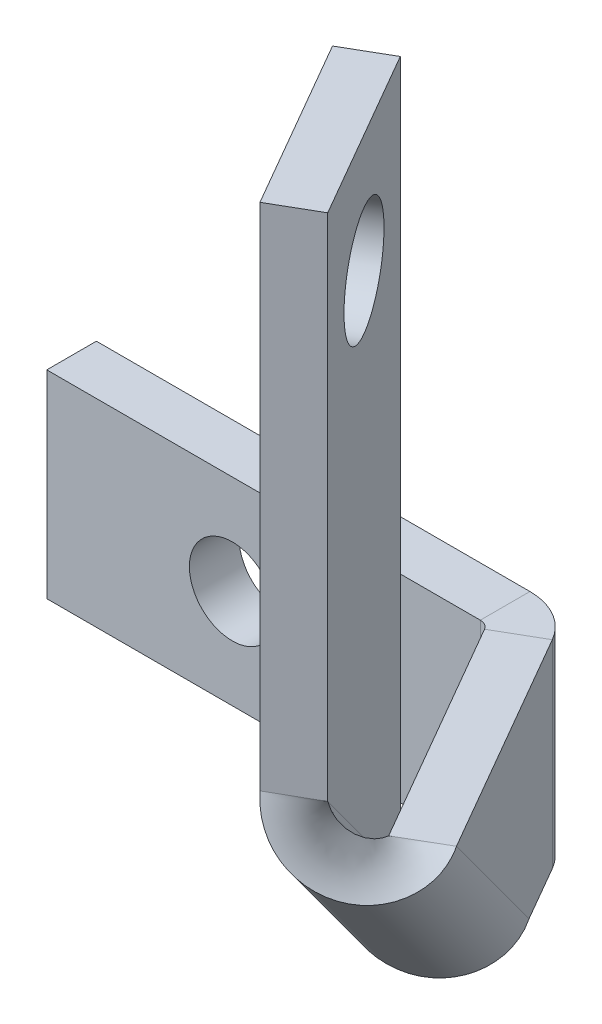
ISO-10303-21;
HEADER;
FILE_DESCRIPTION(('STEP AP214'),'2;1');
FILE_NAME('part.step','',(''),(''),'','','');
FILE_SCHEMA(('AUTOMOTIVE_DESIGN { 1 0 10303 214 1 1 1 1 }'));
ENDSEC;
DATA;
#1=APPLICATION_CONTEXT('core data for automotive mechanical design processes');
#2=APPLICATION_PROTOCOL_DEFINITION('international standard','automotive_design',2000,#1);
#3=PRODUCT_CONTEXT('',#1,'mechanical');
#4=PRODUCT('Part','Part','',(#3));
#5=PRODUCT_RELATED_PRODUCT_CATEGORY('part','',(#4));
#6=PRODUCT_DEFINITION_FORMATION('','',#4);
#7=PRODUCT_DEFINITION_CONTEXT('part definition',#1,'design');
#8=PRODUCT_DEFINITION('design','',#6,#7);
#9=PRODUCT_DEFINITION_SHAPE('','',#8);
#10=(LENGTH_UNIT() NAMED_UNIT(*) SI_UNIT(.MILLI.,.METRE.));
#11=(NAMED_UNIT(*) PLANE_ANGLE_UNIT() SI_UNIT($,.RADIAN.));
#12=(NAMED_UNIT(*) SI_UNIT($,.STERADIAN.) SOLID_ANGLE_UNIT());
#13=UNCERTAINTY_MEASURE_WITH_UNIT(LENGTH_MEASURE(1.E-05),#10,'distance_accuracy_value','');
#14=(GEOMETRIC_REPRESENTATION_CONTEXT(3) GLOBAL_UNCERTAINTY_ASSIGNED_CONTEXT((#13)) GLOBAL_UNIT_ASSIGNED_CONTEXT((#10,
#11,#12)) REPRESENTATION_CONTEXT('',''));
#15=CARTESIAN_POINT('',(0.,0.,0.));
#16=DIRECTION('',(0.,0.,1.));
#17=DIRECTION('',(1.,0.,0.));
#18=AXIS2_PLACEMENT_3D('',#15,#16,#17);
#19=CARTESIAN_POINT('',(-9.18939305453291,0.,13.1697100603442));
#20=DIRECTION('',(0.86602540378444,0.,-0.499999999999998));
#21=DIRECTION('',(-0.499999999999998,0.,-0.86602540378444));
#22=AXIS2_PLACEMENT_3D('',#19,#20,#21);
#23=PLANE('',#22);
#24=DIRECTION('',(0.499999999999998,0.,0.86602540378444));
#25=VECTOR('',#24,1.);
#26=CARTESIAN_POINT('',(13.310606945467,-6.34999999999999,52.140853230644));
#27=LINE('',#26,#25);
#28=CARTESIAN_POINT('',(-16.5802905988794,-6.35,0.368300000000002));
#29=VERTEX_POINT('',#28);
#30=CARTESIAN_POINT('',(-14.5394934598592,-6.35,3.90306433272417));
#31=VERTEX_POINT('',#30);
#32=EDGE_CURVE('E94',#29,#31,#27,.T.);
#33=ORIENTED_EDGE('',*,*,#32,.T.);
#34=DIRECTION('',(0.353553390593272,0.707106781186548,0.612372435695794));
#35=VECTOR('',#34,1.);
#36=CARTESIAN_POINT('',(-10.2769432571961,2.17510040532631,11.2860178535498));
#37=LINE('',#36,#35);
#38=CARTESIAN_POINT('',(-8.18949345985924,6.35,14.9015869607865));
#39=VERTEX_POINT('',#38);
#40=EDGE_CURVE('E87',#31,#39,#37,.T.);
#41=ORIENTED_EDGE('',*,*,#40,.T.);
#42=DIRECTION('',(-0.499999999999998,0.,-0.86602540378444));
#43=VECTOR('',#42,1.);
#44=CARTESIAN_POINT('',(13.310606945467,6.35000000000001,52.140853230644));
#45=LINE('',#44,#43);
#46=CARTESIAN_POINT('',(-16.5802905988794,6.35,0.368300000000002));
#47=VERTEX_POINT('',#46);
#48=EDGE_CURVE('E102',#39,#47,#45,.T.);
#49=ORIENTED_EDGE('',*,*,#48,.T.);
#50=DIRECTION('',(0.,-1.,0.));
#51=VECTOR('',#50,1.);
#52=CARTESIAN_POINT('',(-16.5802905988794,0.,0.368299999999992));
#53=LINE('',#52,#51);
#54=EDGE_CURVE('E390',#47,#29,#53,.T.);
#55=ORIENTED_EDGE('',*,*,#54,.T.);
#56=EDGE_LOOP('',(#33,#41,#49,#55));
#57=FACE_BOUND('',#56,.T.);
#58=ADVANCED_FACE('F76',(#57),#23,.F.);
#59=CARTESIAN_POINT('',(16.0645677295015,6.35000000000001,50.550853230644));
#60=DIRECTION('',(0.,1.,0.));
#61=DIRECTION('',(-0.499999999999998,0.,-0.86602540378444));
#62=AXIS2_PLACEMENT_3D('',#59,#60,#61);
#63=PLANE('',#62);
#64=CARTESIAN_POINT('',(-5.43553267582471,6.35,13.3115869607865));
#65=CARTESIAN_POINT('',(-8.18949345985923,6.35,14.9015869607865));
#66=B_SPLINE_CURVE_WITH_KNOTS('',1,(#64,#65),.UNSPECIFIED.,.F.,.F.,(2,2),(0.,1.),.UNSPECIFIED.);
#67=CARTESIAN_POINT('',(-5.43553267582471,6.35,13.3115869607865));
#68=VERTEX_POINT('',#67);
#69=EDGE_CURVE('E312',#68,#39,#66,.T.);
#70=ORIENTED_EDGE('',*,*,#69,.F.);
#71=DIRECTION('',(-0.499999999999998,0.,-0.86602540378444));
#72=VECTOR('',#71,1.);
#73=CARTESIAN_POINT('',(16.0645677295015,6.35000000000001,50.550853230644));
#74=LINE('',#73,#72);
#75=CARTESIAN_POINT('',(-13.8263298148448,6.35,-1.22169999999999));
#76=VERTEX_POINT('',#75);
#77=EDGE_CURVE('E386',#68,#76,#74,.T.);
#78=ORIENTED_EDGE('',*,*,#77,.T.);
#79=DIRECTION('',(0.86602540378444,0.,-0.499999999999998));
#80=VECTOR('',#79,1.);
#81=CARTESIAN_POINT('',(-13.8263298148449,6.35,-1.2217));
#82=LINE('',#81,#80);
#83=EDGE_CURVE('E393',#47,#76,#82,.T.);
#84=ORIENTED_EDGE('',*,*,#83,.F.);
#85=ORIENTED_EDGE('',*,*,#48,.F.);
#86=EDGE_LOOP('',(#70,#78,#84,#85));
#87=FACE_BOUND('',#86,.T.);
#88=ADVANCED_FACE('F435',(#87),#63,.T.);
#89=CARTESIAN_POINT('',(16.0645677295015,-6.34999999999999,50.550853230644));
#90=DIRECTION('',(0.,-1.,0.));
#91=DIRECTION('',(0.499999999999998,0.,0.86602540378444));
#92=AXIS2_PLACEMENT_3D('',#89,#90,#91);
#93=PLANE('',#92);
#94=CARTESIAN_POINT('',(-14.5394934598592,-6.35,3.90306433272418));
#95=CARTESIAN_POINT('',(-11.7855326758247,-6.35,2.31306433272419));
#96=B_SPLINE_CURVE_WITH_KNOTS('',1,(#94,#95),.UNSPECIFIED.,.F.,.F.,(2,2),(0.,1.),.UNSPECIFIED.);
#97=CARTESIAN_POINT('',(-11.7855326758247,-6.35,2.31306433272419));
#98=VERTEX_POINT('',#97);
#99=EDGE_CURVE('E14',#31,#98,#96,.T.);
#100=ORIENTED_EDGE('',*,*,#99,.F.);
#101=ORIENTED_EDGE('',*,*,#32,.F.);
#102=DIRECTION('',(-0.86602540378444,0.,0.499999999999998));
#103=VECTOR('',#102,1.);
#104=CARTESIAN_POINT('',(-13.8263298148449,-6.35,-1.2217));
#105=LINE('',#104,#103);
#106=CARTESIAN_POINT('',(-13.8263298148449,-6.35,-1.22169999999999));
#107=VERTEX_POINT('',#106);
#108=EDGE_CURVE('E385',#107,#29,#105,.T.);
#109=ORIENTED_EDGE('',*,*,#108,.F.);
#110=DIRECTION('',(0.499999999999998,0.,0.86602540378444));
#111=VECTOR('',#110,1.);
#112=CARTESIAN_POINT('',(16.0645677295015,-6.34999999999999,50.550853230644));
#113=LINE('',#112,#111);
#114=EDGE_CURVE('E398',#107,#98,#113,.T.);
#115=ORIENTED_EDGE('',*,*,#114,.T.);
#116=EDGE_LOOP('',(#100,#101,#109,#115));
#117=FACE_BOUND('',#116,.T.);
#118=ADVANCED_FACE('F78',(#117),#93,.T.);
#119=CARTESIAN_POINT('',(-6.43543227049839,0.,11.5797100603442));
#120=DIRECTION('',(0.86602540378444,0.,-0.499999999999998));
#121=DIRECTION('',(-0.499999999999998,0.,-0.86602540378444));
#122=AXIS2_PLACEMENT_3D('',#119,#120,#121);
#123=PLANE('',#122);
#124=DIRECTION('',(0.353553390593272,0.707106781186548,0.612372435695794));
#125=VECTOR('',#124,1.);
#126=CARTESIAN_POINT('',(-7.52298247316154,2.17510040532631,9.69601785354977));
#127=LINE('',#126,#125);
#128=EDGE_CURVE('E397',#98,#68,#127,.T.);
#129=ORIENTED_EDGE('',*,*,#128,.F.);
#130=ORIENTED_EDGE('',*,*,#114,.F.);
#131=DIRECTION('',(0.,-1.,0.));
#132=VECTOR('',#131,1.);
#133=CARTESIAN_POINT('',(-13.8263298148449,0.,-1.2217));
#134=LINE('',#133,#132);
#135=EDGE_CURVE('E381',#76,#107,#134,.T.);
#136=ORIENTED_EDGE('',*,*,#135,.F.);
#137=ORIENTED_EDGE('',*,*,#77,.F.);
#138=EDGE_LOOP('',(#129,#130,#136,#137));
#139=FACE_BOUND('',#138,.T.);
#140=ADVANCED_FACE('F444',(#139),#123,.T.);
#141=CARTESIAN_POINT('',(-45.,6.34999999999999,-3.18));
#142=DIRECTION('',(-1.,0.,0.));
#143=DIRECTION('',(0.,0.,1.));
#144=AXIS2_PLACEMENT_3D('',#141,#142,#143);
#145=PLANE('',#144);
#146=DIRECTION('',(0.,-1.,0.));
#147=VECTOR('',#146,1.);
#148=CARTESIAN_POINT('',(-45.,6.34999999999999,0.));
#149=LINE('',#148,#147);
#150=CARTESIAN_POINT('',(-45.,6.34999999999999,0.));
#151=VERTEX_POINT('',#150);
#152=CARTESIAN_POINT('',(-45.,-6.35,0.));
#153=VERTEX_POINT('',#152);
#154=EDGE_CURVE('E352',#151,#153,#149,.T.);
#155=ORIENTED_EDGE('',*,*,#154,.F.);
#156=DIRECTION('',(0.,0.,1.));
#157=VECTOR('',#156,1.);
#158=CARTESIAN_POINT('',(-45.,6.34999999999999,-3.18));
#159=LINE('',#158,#157);
#160=CARTESIAN_POINT('',(-45.,6.34999999999999,-3.18));
#161=VERTEX_POINT('',#160);
#162=EDGE_CURVE('E337',#161,#151,#159,.T.);
#163=ORIENTED_EDGE('',*,*,#162,.F.);
#164=DIRECTION('',(0.,-1.,0.));
#165=VECTOR('',#164,1.);
#166=CARTESIAN_POINT('',(-45.,6.34999999999999,-3.18));
#167=LINE('',#166,#165);
#168=CARTESIAN_POINT('',(-45.,-6.35,-3.18));
#169=VERTEX_POINT('',#168);
#170=EDGE_CURVE('E374',#161,#169,#167,.T.);
#171=ORIENTED_EDGE('',*,*,#170,.T.);
#172=DIRECTION('',(0.,0.,1.));
#173=VECTOR('',#172,1.);
#174=CARTESIAN_POINT('',(-45.,-6.35,-3.18));
#175=LINE('',#174,#173);
#176=EDGE_CURVE('E371',#169,#153,#175,.T.);
#177=ORIENTED_EDGE('',*,*,#176,.T.);
#178=EDGE_LOOP('',(#155,#163,#171,#177));
#179=FACE_BOUND('',#178,.T.);
#180=ADVANCED_FACE('F465',(#179),#145,.T.);
#181=CARTESIAN_POINT('',(0.,0.,-3.18));
#182=DIRECTION('',(0.,0.,-1.));
#183=DIRECTION('',(-1.,0.,0.));
#184=AXIS2_PLACEMENT_3D('',#181,#182,#183);
#185=PLANE('',#184);
#186=CARTESIAN_POINT('',(-33.1113304389457,0.,-3.18));
#187=DIRECTION('',(0.,0.,-1.));
#188=DIRECTION('',(-1.,0.,0.));
#189=AXIS2_PLACEMENT_3D('',#186,#187,#188);
#190=CIRCLE('',#189,2.75);
#191=CARTESIAN_POINT('',(-35.8613304389457,0.,-3.18));
#192=VERTEX_POINT('',#191);
#193=EDGE_CURVE('E743',#192,#192,#190,.T.);
#194=ORIENTED_EDGE('',*,*,#193,.F.);
#195=EDGE_LOOP('',(#194));
#196=FACE_BOUND('',#195,.T.);
#197=DIRECTION('',(-1.,0.,0.));
#198=VECTOR('',#197,1.);
#199=CARTESIAN_POINT('',(45.,6.35000000000001,-3.18));
#200=LINE('',#199,#198);
#201=CARTESIAN_POINT('',(-17.218204911307,6.35,-3.18));
#202=VERTEX_POINT('',#201);
#203=EDGE_CURVE('E341',#202,#161,#200,.T.);
#204=ORIENTED_EDGE('',*,*,#203,.F.);
#205=DIRECTION('',(0.,-1.,0.));
#206=VECTOR('',#205,1.);
#207=CARTESIAN_POINT('',(-17.218204911307,0.,-3.18));
#208=LINE('',#207,#206);
#209=CARTESIAN_POINT('',(-17.218204911307,-6.35,-3.18));
#210=VERTEX_POINT('',#209);
#211=EDGE_CURVE('E367',#202,#210,#208,.T.);
#212=ORIENTED_EDGE('',*,*,#211,.T.);
#213=DIRECTION('',(1.,0.,0.));
#214=VECTOR('',#213,1.);
#215=CARTESIAN_POINT('',(45.,-6.34999999999999,-3.18));
#216=LINE('',#215,#214);
#217=EDGE_CURVE('E363',#169,#210,#216,.T.);
#218=ORIENTED_EDGE('',*,*,#217,.F.);
#219=ORIENTED_EDGE('',*,*,#170,.F.);
#220=EDGE_LOOP('',(#204,#212,#218,#219));
#221=FACE_BOUND('',#220,.T.);
#222=ADVANCED_FACE('F473',(#196,#221),#185,.T.);
#223=CARTESIAN_POINT('',(45.,-6.34999999999999,-3.18));
#224=DIRECTION('',(0.,-1.,0.));
#225=DIRECTION('',(1.,0.,0.));
#226=AXIS2_PLACEMENT_3D('',#223,#224,#225);
#227=PLANE('',#226);
#228=ORIENTED_EDGE('',*,*,#217,.T.);
#229=DIRECTION('',(0.,0.,1.));
#230=VECTOR('',#229,1.);
#231=CARTESIAN_POINT('',(-17.218204911307,-6.35,-3.18));
#232=LINE('',#231,#230);
#233=CARTESIAN_POINT('',(-17.218204911307,-6.35,0.));
#234=VERTEX_POINT('',#233);
#235=EDGE_CURVE('E359',#210,#234,#232,.T.);
#236=ORIENTED_EDGE('',*,*,#235,.T.);
#237=DIRECTION('',(1.,0.,0.));
#238=VECTOR('',#237,1.);
#239=CARTESIAN_POINT('',(45.,-6.34999999999999,0.));
#240=LINE('',#239,#238);
#241=EDGE_CURVE('E348',#153,#234,#240,.T.);
#242=ORIENTED_EDGE('',*,*,#241,.F.);
#243=ORIENTED_EDGE('',*,*,#176,.F.);
#244=EDGE_LOOP('',(#228,#236,#242,#243));
#245=FACE_BOUND('',#244,.T.);
#246=ADVANCED_FACE('F482',(#245),#227,.T.);
#247=CARTESIAN_POINT('',(0.,0.,0.));
#248=DIRECTION('',(0.,0.,-1.));
#249=DIRECTION('',(-1.,0.,0.));
#250=AXIS2_PLACEMENT_3D('',#247,#248,#249);
#251=PLANE('',#250);
#252=CARTESIAN_POINT('',(-33.1113304389457,0.,0.));
#253=DIRECTION('',(0.,0.,-1.));
#254=DIRECTION('',(-1.,0.,0.));
#255=AXIS2_PLACEMENT_3D('',#252,#253,#254);
#256=CIRCLE('',#255,2.75);
#257=CARTESIAN_POINT('',(-35.8613304389457,0.,0.));
#258=VERTEX_POINT('',#257);
#259=EDGE_CURVE('E81',#258,#258,#256,.T.);
#260=ORIENTED_EDGE('',*,*,#259,.T.);
#261=EDGE_LOOP('',(#260));
#262=FACE_BOUND('',#261,.T.);
#263=DIRECTION('',(0.,-1.,0.));
#264=VECTOR('',#263,1.);
#265=CARTESIAN_POINT('',(-17.218204911307,0.,0.));
#266=LINE('',#265,#264);
#267=CARTESIAN_POINT('',(-17.218204911307,6.35,0.));
#268=VERTEX_POINT('',#267);
#269=EDGE_CURVE('E330',#268,#234,#266,.T.);
#270=ORIENTED_EDGE('',*,*,#269,.F.);
#271=DIRECTION('',(-1.,0.,0.));
#272=VECTOR('',#271,1.);
#273=CARTESIAN_POINT('',(45.,6.35000000000001,0.));
#274=LINE('',#273,#272);
#275=EDGE_CURVE('E356',#268,#151,#274,.T.);
#276=ORIENTED_EDGE('',*,*,#275,.T.);
#277=ORIENTED_EDGE('',*,*,#154,.T.);
#278=ORIENTED_EDGE('',*,*,#241,.T.);
#279=EDGE_LOOP('',(#270,#276,#277,#278));
#280=FACE_BOUND('',#279,.T.);
#281=ADVANCED_FACE('F491',(#262,#280),#251,.F.);
#282=CARTESIAN_POINT('',(45.,6.35000000000001,-3.18));
#283=DIRECTION('',(0.,1.,0.));
#284=DIRECTION('',(-1.,0.,0.));
#285=AXIS2_PLACEMENT_3D('',#282,#283,#284);
#286=PLANE('',#285);
#287=ORIENTED_EDGE('',*,*,#275,.F.);
#288=DIRECTION('',(0.,0.,-1.));
#289=VECTOR('',#288,1.);
#290=CARTESIAN_POINT('',(-17.218204911307,6.35,-3.18));
#291=LINE('',#290,#289);
#292=EDGE_CURVE('E344',#268,#202,#291,.T.);
#293=ORIENTED_EDGE('',*,*,#292,.T.);
#294=ORIENTED_EDGE('',*,*,#203,.T.);
#295=ORIENTED_EDGE('',*,*,#162,.T.);
#296=EDGE_LOOP('',(#287,#293,#294,#295));
#297=FACE_BOUND('',#296,.T.);
#298=ADVANCED_FACE('F499',(#297),#286,.T.);
#299=CARTESIAN_POINT('',(-17.218204911307,6.35,0.7366));
#300=DIRECTION('',(0.,1.,0.));
#301=DIRECTION('',(0.,0.,1.));
#302=AXIS2_PLACEMENT_3D('',#299,#300,#301);
#303=PLANE('',#302);
#304=ORIENTED_EDGE('',*,*,#292,.F.);
#305=CARTESIAN_POINT('',(-17.218204911307,6.35,0.7366));
#306=DIRECTION('',(0.,-1.,0.));
#307=DIRECTION('',(0.,0.,-1.));
#308=AXIS2_PLACEMENT_3D('',#305,#306,#307);
#309=CIRCLE('',#308,0.7366);
#310=EDGE_CURVE('E331',#268,#47,#309,.T.);
#311=ORIENTED_EDGE('',*,*,#310,.T.);
#312=ORIENTED_EDGE('',*,*,#83,.T.);
#313=CARTESIAN_POINT('',(-17.218204911307,6.35,0.7366));
#314=DIRECTION('',(0.,-1.,0.));
#315=DIRECTION('',(0.,0.,1.));
#316=AXIS2_PLACEMENT_3D('',#313,#314,#315);
#317=CIRCLE('',#316,3.9166);
#318=EDGE_CURVE('E316',#202,#76,#317,.T.);
#319=ORIENTED_EDGE('',*,*,#318,.F.);
#320=EDGE_LOOP('',(#304,#311,#312,#319));
#321=FACE_BOUND('',#320,.T.);
#322=ADVANCED_FACE('F507',(#321),#303,.T.);
#323=CARTESIAN_POINT('',(-17.218204911307,-6.35,0.7366));
#324=DIRECTION('',(0.,-1.,0.));
#325=DIRECTION('',(0.,0.,-1.));
#326=AXIS2_PLACEMENT_3D('',#323,#324,#325);
#327=PLANE('',#326);
#328=CARTESIAN_POINT('',(-17.218204911307,-6.35,0.7366));
#329=DIRECTION('',(0.,-1.,0.));
#330=DIRECTION('',(0.,0.,-1.));
#331=AXIS2_PLACEMENT_3D('',#328,#329,#330);
#332=CIRCLE('',#331,0.7366);
#333=EDGE_CURVE('E326',#29,#234,#332,.F.);
#334=ORIENTED_EDGE('',*,*,#333,.T.);
#335=ORIENTED_EDGE('',*,*,#235,.F.);
#336=CARTESIAN_POINT('',(-17.218204911307,-6.35,0.7366));
#337=DIRECTION('',(0.,1.,0.));
#338=DIRECTION('',(0.,0.,-1.));
#339=AXIS2_PLACEMENT_3D('',#336,#337,#338);
#340=CIRCLE('',#339,3.9166);
#341=EDGE_CURVE('E325',#107,#210,#340,.T.);
#342=ORIENTED_EDGE('',*,*,#341,.F.);
#343=ORIENTED_EDGE('',*,*,#108,.T.);
#344=EDGE_LOOP('',(#334,#335,#342,#343));
#345=FACE_BOUND('',#344,.T.);
#346=ADVANCED_FACE('F514',(#345),#327,.T.);
#347=CARTESIAN_POINT('',(-17.218204911307,13.3168499587451,0.7366));
#348=DIRECTION('',(0.,-1.,0.));
#349=DIRECTION('',(0.,0.,-1.));
#350=AXIS2_PLACEMENT_3D('',#347,#348,#349);
#351=CYLINDRICAL_SURFACE('',#350,3.9166);
#352=ORIENTED_EDGE('',*,*,#135,.T.);
#353=ORIENTED_EDGE('',*,*,#341,.T.);
#354=ORIENTED_EDGE('',*,*,#211,.F.);
#355=ORIENTED_EDGE('',*,*,#318,.T.);
#356=EDGE_LOOP('',(#352,#353,#354,#355));
#357=FACE_BOUND('',#356,.T.);
#358=ADVANCED_FACE('F287',(#357),#351,.T.);
#359=CARTESIAN_POINT('',(-17.218204911307,13.3168499587451,0.7366));
#360=DIRECTION('',(0.,-1.,0.));
#361=DIRECTION('',(0.,0.,-1.));
#362=AXIS2_PLACEMENT_3D('',#359,#360,#361);
#363=CYLINDRICAL_SURFACE('',#362,0.7366);
#364=ORIENTED_EDGE('',*,*,#54,.F.);
#365=ORIENTED_EDGE('',*,*,#310,.F.);
#366=ORIENTED_EDGE('',*,*,#269,.T.);
#367=ORIENTED_EDGE('',*,*,#333,.F.);
#368=EDGE_LOOP('',(#364,#365,#366,#367));
#369=FACE_BOUND('',#368,.T.);
#370=ADVANCED_FACE('F529',(#369),#363,.F.);
#371=CARTESIAN_POINT('',(-15.9850800077692,-1.18159427804031,10.705634985006));
#372=CARTESIAN_POINT('',(-15.9114849524444,-1.75954226471122,10.8331053600143));
#373=CARTESIAN_POINT('',(-15.7496993988209,-2.33719358992409,10.9094489296991));
#374=CARTESIAN_POINT('',(-15.290304773034,-3.43774504247904,10.9203645286645));
#375=CARTESIAN_POINT('',(-14.9929709908232,-3.96030459955171,10.8547685188772));
#376=CARTESIAN_POINT('',(-14.3240760255731,-4.90368681750876,10.5632456406514));
#377=CARTESIAN_POINT('',(-13.9528627552625,-5.32430776002056,10.337286715407));
#378=CARTESIAN_POINT('',(-13.2090857671046,-6.03246959576467,9.7309215791188));
#379=CARTESIAN_POINT('',(-12.8368994248643,-6.31990131980042,9.35060718825324));
#380=CARTESIAN_POINT('',(-12.1642588395343,-6.75060179663039,8.46492789276935));
#381=CARTESIAN_POINT('',(-11.8641539829148,-6.89387054942462,7.9597647065236));
#382=CARTESIAN_POINT('',(-11.397838353671,-7.04710966734046,6.87282239945903));
#383=CARTESIAN_POINT('',(-11.2318957874572,-7.05718920165865,6.29132418541352));
#384=CARTESIAN_POINT('',(-11.0756825633342,-6.97520793736154,5.11181048344273));
#385=CARTESIAN_POINT('',(-11.085558099781,-6.88334885711885,4.51411232518167));
#386=CARTESIAN_POINT('',(-11.2960144497191,-6.64419835822384,3.3648120006918));
#387=CARTESIAN_POINT('',(-11.4965586824892,-6.49719011064947,2.81358197124727));
#388=CARTESIAN_POINT('',(-11.7855326758247,-6.35,2.31306433272419));
#389=CARTESIAN_POINT('',(-13.2311192237346,-1.18159427804034,9.11563498500607));
#390=CARTESIAN_POINT('',(-13.3047056810864,-1.46512891471955,8.98817950212379));
#391=CARTESIAN_POINT('',(-13.361699931902,-1.74862741123058,8.85111911123959));
#392=CARTESIAN_POINT('',(-13.4501500357689,-2.3053076227077,8.55032459746315));
#393=CARTESIAN_POINT('',(-13.4816546099157,-2.57843511285205,8.38656415926761));
#394=CARTESIAN_POINT('',(-13.5307037154553,-3.10555630420845,8.02888965205323));
#395=CARTESIAN_POINT('',(-13.5483136792425,-3.35951206798669,7.83496955406967));
#396=CARTESIAN_POINT('',(-13.5832796264116,-3.84239505949168,7.41808225839368));
#397=CARTESIAN_POINT('',(-13.6007065833093,-4.0713017556272,7.19513232944028));
#398=CARTESIAN_POINT('',(-13.6490512452625,-4.50200223245717,6.72571406055703));
#399=CARTESIAN_POINT('',(-13.6800346598807,-4.70379601315161,6.479283658061));
#400=CARTESIAN_POINT('',(-13.7671831217248,-5.08231397530657,5.97201359570118));
#401=CARTESIAN_POINT('',(-13.8233986108753,-5.25905868835832,5.71122676633558));
#402=CARTESIAN_POINT('',(-13.9688684309414,-5.59333845066186,5.18654668265934));
#403=CARTESIAN_POINT('',(-14.0581502568175,-5.75091143734747,4.92271310894682));
#404=CARTESIAN_POINT('',(-14.2725800953315,-6.05563217953029,4.40371529403747));
#405=CARTESIAN_POINT('',(-14.3977261415196,-6.20282708529644,4.14861253094116));
#406=CARTESIAN_POINT('',(-14.5394934598592,-6.35,3.90306433272418));
#407=B_SPLINE_SURFACE_WITH_KNOTS('',1,3,((#371,#372,#373,#374,#375,#376,#377,#378,#379,#380,
#381,#382,#383,#384,#385,#386,#387,#388),(#389,#390,#391,#392,#393,#394,#395,#396,#397,#398,
#399,#400,#401,#402,#403,#404,#405,#406)),.UNSPECIFIED.,.F.,.F.,.F.,(2,2),(4,2,2,2,2,2,2,2,4),
(0.,1.),(0.,0.125,0.25,0.375,0.5,0.625,0.75,0.875,1.),.UNSPECIFIED.);
#408=CARTESIAN_POINT('',(-15.9850800077692,-1.18159427804031,10.705634985006));
#409=CARTESIAN_POINT('',(-13.2311192237346,-1.18159427804034,9.11563498500607));
#410=B_SPLINE_CURVE_WITH_KNOTS('',1,(#408,#409),.UNSPECIFIED.,.F.,.F.,(2,2),(0.,1.),.UNSPECIFIED.);
#411=CARTESIAN_POINT('',(-13.2311192237346,-1.18159427804037,9.11563498500607));
#412=VERTEX_POINT('',#411);
#413=CARTESIAN_POINT('',(-15.9850800077692,-1.18159427804031,10.705634985006));
#414=VERTEX_POINT('',#413);
#415=EDGE_CURVE('E175',#412,#414,#410,.F.);
#416=CARTESIAN_POINT('',(-13.2311192237346,-1.18159427804034,9.11563498500607));
#417=CARTESIAN_POINT('',(-13.3047056810864,-1.46512891471955,8.98817950212379));
#418=CARTESIAN_POINT('',(-13.361699931902,-1.74862741123058,8.85111911123959));
#419=CARTESIAN_POINT('',(-13.4501500357689,-2.3053076227077,8.55032459746315));
#420=CARTESIAN_POINT('',(-13.4816546099157,-2.57843511285205,8.38656415926761));
#421=CARTESIAN_POINT('',(-13.5307037154553,-3.10555630420845,8.02888965205323));
#422=CARTESIAN_POINT('',(-13.5483136792425,-3.35951206798669,7.83496955406967));
#423=CARTESIAN_POINT('',(-13.5832796264116,-3.84239505949168,7.41808225839368));
#424=CARTESIAN_POINT('',(-13.6007065833093,-4.0713017556272,7.19513232944028));
#425=CARTESIAN_POINT('',(-13.6490512452625,-4.50200223245717,6.72571406055703));
#426=CARTESIAN_POINT('',(-13.6800346598807,-4.70379601315161,6.479283658061));
#427=CARTESIAN_POINT('',(-13.7671831217248,-5.08231397530657,5.97201359570118));
#428=CARTESIAN_POINT('',(-13.8233986108753,-5.25905868835832,5.71122676633558));
#429=CARTESIAN_POINT('',(-13.9688684309414,-5.59333845066186,5.18654668265934));
#430=CARTESIAN_POINT('',(-14.0581502568175,-5.75091143734747,4.92271310894682));
#431=CARTESIAN_POINT('',(-14.2725800953315,-6.05563217953029,4.40371529403747));
#432=CARTESIAN_POINT('',(-14.3977261415196,-6.20282708529644,4.14861253094116));
#433=CARTESIAN_POINT('',(-14.5394934598592,-6.35,3.90306433272418));
#434=B_SPLINE_CURVE_WITH_KNOTS('',3,(#416,#417,#418,#419,#420,#421,#422,#423,#424,#425,#426,
#427,#428,#429,#430,#431,#432,#433),.UNSPECIFIED.,.F.,.F.,(4,2,2,2,2,2,2,2,4),(0.,0.125,0.25,
0.375,0.5,0.625,0.75,0.875,1.),.UNSPECIFIED.);
#435=EDGE_CURVE('E190',#412,#31,#434,.T.);
#436=CARTESIAN_POINT('',(-11.7855326758247,-6.35,2.31306433272419));
#437=CARTESIAN_POINT('',(-11.4965586824892,-6.49719011064947,2.81358197124727));
#438=CARTESIAN_POINT('',(-11.2960144497191,-6.64419835822384,3.3648120006918));
#439=CARTESIAN_POINT('',(-11.085558099781,-6.88334885711885,4.51411232518167));
#440=CARTESIAN_POINT('',(-11.0756825633342,-6.97520793736154,5.11181048344273));
#441=CARTESIAN_POINT('',(-11.2318957874572,-7.05718920165865,6.29132418541352));
#442=CARTESIAN_POINT('',(-11.397838353671,-7.04710966734046,6.87282239945903));
#443=CARTESIAN_POINT('',(-11.8641539829148,-6.89387054942462,7.9597647065236));
#444=CARTESIAN_POINT('',(-12.1642588395343,-6.75060179663039,8.46492789276935));
#445=CARTESIAN_POINT('',(-12.8368994248643,-6.31990131980042,9.35060718825324));
#446=CARTESIAN_POINT('',(-13.2090857671046,-6.03246959576467,9.7309215791188));
#447=CARTESIAN_POINT('',(-13.9528627552625,-5.32430776002056,10.337286715407));
#448=CARTESIAN_POINT('',(-14.3240760255731,-4.90368681750876,10.5632456406514));
#449=CARTESIAN_POINT('',(-14.9929709908232,-3.96030459955171,10.8547685188772));
#450=CARTESIAN_POINT('',(-15.290304773034,-3.43774504247904,10.9203645286645));
#451=CARTESIAN_POINT('',(-15.7496993988209,-2.33719358992409,10.9094489296991));
#452=CARTESIAN_POINT('',(-15.9114849524444,-1.75954226471122,10.8331053600143));
#453=CARTESIAN_POINT('',(-15.9850800077692,-1.18159427804031,10.705634985006));
#454=B_SPLINE_CURVE_WITH_KNOTS('',3,(#436,#437,#438,#439,#440,#441,#442,#443,#444,#445,#446,
#447,#448,#449,#450,#451,#452,#453),.UNSPECIFIED.,.F.,.F.,(4,2,2,2,2,2,2,2,4),(0.,0.125,0.25,
0.375,0.5,0.625,0.75,0.875,1.),.UNSPECIFIED.);
#455=EDGE_CURVE('E753',#414,#98,#454,.F.);
#456=ORIENTED_EDGE('',*,*,#415,.F.);
#457=ORIENTED_EDGE('',*,*,#435,.T.);
#458=ORIENTED_EDGE('',*,*,#99,.T.);
#459=ORIENTED_EDGE('',*,*,#455,.F.);
#460=EDGE_LOOP('',(#456,#457,#458,#459));
#461=FACE_BOUND('',#460,.T.);
#462=ADVANCED_FACE('F283',(#461),#407,.T.);
#463=CARTESIAN_POINT('',(-5.43553267582471,6.35,13.3115869607865));
#464=CARTESIAN_POINT('',(-5.14655868248925,6.20280988935053,13.8121045993096));
#465=CARTESIAN_POINT('',(-4.94601444971913,6.05580164177616,14.3633346287542));
#466=CARTESIAN_POINT('',(-4.73555809978109,5.81665114288115,15.512634953244));
#467=CARTESIAN_POINT('',(-4.72568256333426,5.72479206263846,16.1103331115051));
#468=CARTESIAN_POINT('',(-4.88189578745725,5.64281079834135,17.2898468134759));
#469=CARTESIAN_POINT('',(-5.04783835367105,5.65289033265953,17.8713450275214));
#470=CARTESIAN_POINT('',(-5.51415398291482,5.80612945057537,18.9582873345859));
#471=CARTESIAN_POINT('',(-5.81425883953436,5.94939820336961,19.4634505208317));
#472=CARTESIAN_POINT('',(-6.48689942486435,6.38009868019958,20.3491298163156));
#473=CARTESIAN_POINT('',(-6.85908576710465,6.66753040423532,20.7294442071811));
#474=CARTESIAN_POINT('',(-7.60286275526255,7.37569223997944,21.3358093434693));
#475=CARTESIAN_POINT('',(-7.97407602557316,7.79631318249123,21.5617682687137));
#476=CARTESIAN_POINT('',(-8.64297099082321,8.73969540044828,21.8532911469395));
#477=CARTESIAN_POINT('',(-8.94030477303406,9.26225495752094,21.9188871567269));
#478=CARTESIAN_POINT('',(-9.39969939882098,10.3628064100759,21.9079715577615));
#479=CARTESIAN_POINT('',(-9.56148495244447,10.9404577352888,21.8316279880767));
#480=CARTESIAN_POINT('',(-9.6350800077692,11.5184057219597,21.7041576130684));
#481=CARTESIAN_POINT('',(-8.18949345985923,6.35,14.9015869607865));
#482=CARTESIAN_POINT('',(-8.04772614151962,6.49717291470356,15.1471351590035));
#483=CARTESIAN_POINT('',(-7.92258009533157,6.6443678204697,15.4022379220998));
#484=CARTESIAN_POINT('',(-7.70815025681755,6.94908856265252,15.9212357370092));
#485=CARTESIAN_POINT('',(-7.6188684309414,7.10666154933814,16.1850693107217));
#486=CARTESIAN_POINT('',(-7.47339861087536,7.44094131164168,16.7097493943979));
#487=CARTESIAN_POINT('',(-7.41718312172489,7.61768602469342,16.9705362237635));
#488=CARTESIAN_POINT('',(-7.33003465988076,7.99620398684837,17.4778062861233));
#489=CARTESIAN_POINT('',(-7.29905124526251,8.19799776754283,17.7242366886194));
#490=CARTESIAN_POINT('',(-7.25070658330939,8.6286982443728,18.1936549575026));
#491=CARTESIAN_POINT('',(-7.23327962641167,8.85760494050832,18.416604886456));
#492=CARTESIAN_POINT('',(-7.19831367924256,9.3404879320133,18.833492182132));
#493=CARTESIAN_POINT('',(-7.18070371545534,9.59444369579153,19.0274122801156));
#494=CARTESIAN_POINT('',(-7.13165460991572,10.1215648871479,19.3850867873299));
#495=CARTESIAN_POINT('',(-7.10015003576893,10.3946923772923,19.5488472255255));
#496=CARTESIAN_POINT('',(-7.01169993190206,10.9513725887694,19.8496417393019));
#497=CARTESIAN_POINT('',(-6.95470568108645,11.2348710852804,19.9867021301861));
#498=CARTESIAN_POINT('',(-6.88111922373467,11.5184057219596,20.1141576130684));
#499=B_SPLINE_SURFACE_WITH_KNOTS('',1,3,((#463,#464,#465,#466,#467,#468,#469,#470,#471,#472,
#473,#474,#475,#476,#477,#478,#479,#480),(#481,#482,#483,#484,#485,#486,#487,#488,#489,#490,
#491,#492,#493,#494,#495,#496,#497,#498)),.UNSPECIFIED.,.F.,.F.,.F.,(2,2),(4,2,2,2,2,2,2,2,4),
(0.,1.),(0.,0.125,0.25,0.375,0.5,0.625,0.75,0.875,1.),.UNSPECIFIED.);
#500=CARTESIAN_POINT('',(-8.18949345985923,6.35,14.9015869607865));
#501=CARTESIAN_POINT('',(-8.04772614151962,6.49717291470356,15.1471351590035));
#502=CARTESIAN_POINT('',(-7.92258009533157,6.6443678204697,15.4022379220998));
#503=CARTESIAN_POINT('',(-7.70815025681755,6.94908856265252,15.9212357370092));
#504=CARTESIAN_POINT('',(-7.6188684309414,7.10666154933814,16.1850693107217));
#505=CARTESIAN_POINT('',(-7.47339861087536,7.44094131164168,16.7097493943979));
#506=CARTESIAN_POINT('',(-7.41718312172489,7.61768602469342,16.9705362237635));
#507=CARTESIAN_POINT('',(-7.33003465988076,7.99620398684837,17.4778062861233));
#508=CARTESIAN_POINT('',(-7.29905124526251,8.19799776754283,17.7242366886194));
#509=CARTESIAN_POINT('',(-7.25070658330939,8.6286982443728,18.1936549575026));
#510=CARTESIAN_POINT('',(-7.23327962641167,8.85760494050832,18.416604886456));
#511=CARTESIAN_POINT('',(-7.19831367924256,9.3404879320133,18.833492182132));
#512=CARTESIAN_POINT('',(-7.18070371545534,9.59444369579153,19.0274122801156));
#513=CARTESIAN_POINT('',(-7.13165460991572,10.1215648871479,19.3850867873299));
#514=CARTESIAN_POINT('',(-7.10015003576893,10.3946923772923,19.5488472255255));
#515=CARTESIAN_POINT('',(-7.01169993190206,10.9513725887694,19.8496417393019));
#516=CARTESIAN_POINT('',(-6.95470568108645,11.2348710852804,19.9867021301861));
#517=CARTESIAN_POINT('',(-6.88111922373467,11.5184057219596,20.1141576130684));
#518=B_SPLINE_CURVE_WITH_KNOTS('',3,(#500,#501,#502,#503,#504,#505,#506,#507,#508,#509,#510,
#511,#512,#513,#514,#515,#516,#517),.UNSPECIFIED.,.F.,.F.,(4,2,2,2,2,2,2,2,4),(0.,0.125,0.25,
0.375,0.5,0.625,0.75,0.875,1.),.UNSPECIFIED.);
#519=CARTESIAN_POINT('',(-6.88111922373466,11.5184057219596,20.1141576130684));
#520=VERTEX_POINT('',#519);
#521=EDGE_CURVE('E255',#39,#520,#518,.T.);
#522=CARTESIAN_POINT('',(-6.88111922373467,11.5184057219596,20.1141576130684));
#523=CARTESIAN_POINT('',(-9.6350800077692,11.5184057219597,21.7041576130684));
#524=B_SPLINE_CURVE_WITH_KNOTS('',1,(#522,#523),.UNSPECIFIED.,.F.,.F.,(2,2),(0.,1.),.UNSPECIFIED.);
#525=CARTESIAN_POINT('',(-9.63508000776918,11.5184057219596,21.7041576130684));
#526=VERTEX_POINT('',#525);
#527=EDGE_CURVE('E723',#526,#520,#524,.F.);
#528=CARTESIAN_POINT('',(-9.6350800077692,11.5184057219597,21.7041576130684));
#529=CARTESIAN_POINT('',(-9.56148495244447,10.9404577352888,21.8316279880767));
#530=CARTESIAN_POINT('',(-9.39969939882098,10.3628064100759,21.9079715577615));
#531=CARTESIAN_POINT('',(-8.94030477303406,9.26225495752094,21.9188871567269));
#532=CARTESIAN_POINT('',(-8.64297099082321,8.73969540044828,21.8532911469395));
#533=CARTESIAN_POINT('',(-7.97407602557316,7.79631318249123,21.5617682687137));
#534=CARTESIAN_POINT('',(-7.60286275526255,7.37569223997944,21.3358093434693));
#535=CARTESIAN_POINT('',(-6.85908576710465,6.66753040423532,20.7294442071811));
#536=CARTESIAN_POINT('',(-6.48689942486435,6.38009868019958,20.3491298163156));
#537=CARTESIAN_POINT('',(-5.81425883953436,5.94939820336961,19.4634505208317));
#538=CARTESIAN_POINT('',(-5.51415398291482,5.80612945057537,18.9582873345859));
#539=CARTESIAN_POINT('',(-5.04783835367105,5.65289033265953,17.8713450275214));
#540=CARTESIAN_POINT('',(-4.88189578745725,5.64281079834135,17.2898468134759));
#541=CARTESIAN_POINT('',(-4.72568256333426,5.72479206263846,16.1103331115051));
#542=CARTESIAN_POINT('',(-4.73555809978109,5.81665114288115,15.512634953244));
#543=CARTESIAN_POINT('',(-4.94601444971913,6.05580164177616,14.3633346287542));
#544=CARTESIAN_POINT('',(-5.14655868248925,6.20280988935053,13.8121045993096));
#545=CARTESIAN_POINT('',(-5.43553267582471,6.35,13.3115869607865));
#546=B_SPLINE_CURVE_WITH_KNOTS('',3,(#528,#529,#530,#531,#532,#533,#534,#535,#536,#537,#538,
#539,#540,#541,#542,#543,#544,#545),.UNSPECIFIED.,.F.,.F.,(4,2,2,2,2,2,2,2,4),(0.,0.125,0.25,
0.375,0.5,0.625,0.75,0.875,1.),.UNSPECIFIED.);
#547=EDGE_CURVE('E249',#68,#526,#546,.F.);
#548=ORIENTED_EDGE('',*,*,#521,.T.);
#549=ORIENTED_EDGE('',*,*,#527,.F.);
#550=ORIENTED_EDGE('',*,*,#547,.F.);
#551=ORIENTED_EDGE('',*,*,#69,.T.);
#552=EDGE_LOOP('',(#548,#549,#550,#551));
#553=FACE_BOUND('',#552,.T.);
#554=ADVANCED_FACE('F225',(#553),#499,.T.);
#555=CARTESIAN_POINT('',(-1.82288155471301,20.3590524351478,27.4020822525727));
#556=DIRECTION('',(-0.353553390593272,-0.707106781186548,-0.612372435695794));
#557=DIRECTION('',(0.,0.654653670707977,-0.755928946018455));
#558=AXIS2_PLACEMENT_3D('',#555,#556,#557);
#559=CYLINDRICAL_SURFACE('',#558,3.9166);
#560=ORIENTED_EDGE('',*,*,#128,.T.);
#561=ORIENTED_EDGE('',*,*,#547,.T.);
#562=DIRECTION('',(0.353553390593272,0.707106781186548,0.612372435695795));
#563=VECTOR('',#562,1.);
#564=CARTESIAN_POINT('',(-14.3067326660858,2.17510040532632,13.6126178535497));
#565=LINE('',#564,#563);
#566=EDGE_CURVE('E201',#414,#526,#565,.T.);
#567=ORIENTED_EDGE('',*,*,#566,.F.);
#568=ORIENTED_EDGE('',*,*,#455,.T.);
#569=EDGE_LOOP('',(#560,#561,#567,#568));
#570=FACE_BOUND('',#569,.T.);
#571=ADVANCED_FACE('F214',(#570),#559,.T.);
#572=CARTESIAN_POINT('',(-1.82288155471301,20.3590524351478,27.4020822525727));
#573=DIRECTION('',(-0.353553390593272,-0.707106781186548,-0.612372435695794));
#574=DIRECTION('',(0.,0.654653670707977,-0.755928946018455));
#575=AXIS2_PLACEMENT_3D('',#572,#573,#574);
#576=CYLINDRICAL_SURFACE('',#575,0.7366);
#577=ORIENTED_EDGE('',*,*,#40,.F.);
#578=ORIENTED_EDGE('',*,*,#435,.F.);
#579=DIRECTION('',(0.353553390593272,0.707106781186548,0.612372435695795));
#580=VECTOR('',#579,1.);
#581=CARTESIAN_POINT('',(-11.5527718820513,2.1751004053263,12.0226178535498));
#582=LINE('',#581,#580);
#583=EDGE_CURVE('E197',#412,#520,#582,.T.);
#584=ORIENTED_EDGE('',*,*,#583,.T.);
#585=ORIENTED_EDGE('',*,*,#521,.F.);
#586=EDGE_LOOP('',(#577,#578,#584,#585));
#587=FACE_BOUND('',#586,.T.);
#588=ADVANCED_FACE('F224',(#587),#576,.F.);
#589=CARTESIAN_POINT('',(-9.63508000776909,44.181795088693,21.7041576130683));
#590=DIRECTION('',(0.,1.,0.));
#591=DIRECTION('',(-0.866025403784442,0.,0.499999999999994));
#592=AXIS2_PLACEMENT_3D('',#589,#590,#591);
#593=PLANE('',#592);
#594=DIRECTION('',(0.499999999999994,0.,0.866025403784442));
#595=VECTOR('',#594,1.);
#596=CARTESIAN_POINT('',(-6.88111922373456,44.181795088693,20.1141576130683));
#597=LINE('',#596,#595);
#598=CARTESIAN_POINT('',(-13.2311192237345,44.181795088693,9.11563498500586));
#599=VERTEX_POINT('',#598);
#600=CARTESIAN_POINT('',(-6.88111922373456,44.181795088693,20.1141576130683));
#601=VERTEX_POINT('',#600);
#602=EDGE_CURVE('E188',#599,#601,#597,.T.);
#603=ORIENTED_EDGE('',*,*,#602,.F.);
#604=DIRECTION('',(0.866025403784442,0.,-0.499999999999994));
#605=VECTOR('',#604,1.);
#606=CARTESIAN_POINT('',(-15.985080007769,44.181795088693,10.7056349850058));
#607=LINE('',#606,#605);
#608=CARTESIAN_POINT('',(-15.985080007769,44.181795088693,10.7056349850058));
#609=VERTEX_POINT('',#608);
#610=EDGE_CURVE('E172',#609,#599,#607,.T.);
#611=ORIENTED_EDGE('',*,*,#610,.F.);
#612=DIRECTION('',(0.499999999999994,0.,0.866025403784442));
#613=VECTOR('',#612,1.);
#614=CARTESIAN_POINT('',(-9.63508000776909,44.181795088693,21.7041576130683));
#615=LINE('',#614,#613);
#616=CARTESIAN_POINT('',(-9.63508000776909,44.181795088693,21.7041576130683));
#617=VERTEX_POINT('',#616);
#618=EDGE_CURVE('E185',#609,#617,#615,.T.);
#619=ORIENTED_EDGE('',*,*,#618,.T.);
#620=DIRECTION('',(0.866025403784442,0.,-0.499999999999994));
#621=VECTOR('',#620,1.);
#622=CARTESIAN_POINT('',(-9.63508000776909,44.181795088693,21.7041576130683));
#623=LINE('',#622,#621);
#624=EDGE_CURVE('E196',#617,#601,#623,.T.);
#625=ORIENTED_EDGE('',*,*,#624,.T.);
#626=EDGE_LOOP('',(#603,#611,#619,#625));
#627=FACE_BOUND('',#626,.T.);
#628=ADVANCED_FACE('F184',(#627),#593,.T.);
#629=CARTESIAN_POINT('',(-12.8100800077692,-0.818204911307014,16.2048962990373));
#630=DIRECTION('',(-0.866025403784442,0.,0.499999999999994));
#631=DIRECTION('',(0.,-1.,0.));
#632=AXIS2_PLACEMENT_3D('',#629,#630,#631);
#633=PLANE('',#632);
#634=CARTESIAN_POINT('',(-12.8100800077691,36.6349999999772,16.204896299037));
#635=DIRECTION('',(-0.866025403784442,0.,0.499999999999994));
#636=DIRECTION('',(0.499999999999994,0.,0.866025403784442));
#637=AXIS2_PLACEMENT_3D('',#634,#635,#636);
#638=CIRCLE('',#637,3.5);
#639=CARTESIAN_POINT('',(-11.0600800077691,36.6349999999772,19.2359852122826));
#640=VERTEX_POINT('',#639);
#641=EDGE_CURVE('E735',#640,#640,#638,.T.);
#642=ORIENTED_EDGE('',*,*,#641,.F.);
#643=EDGE_LOOP('',(#642));
#644=FACE_BOUND('',#643,.T.);
#645=DIRECTION('',(0.,1.,0.));
#646=VECTOR('',#645,1.);
#647=CARTESIAN_POINT('',(-15.985080007769,44.181795088693,10.7056349850058));
#648=LINE('',#647,#646);
#649=EDGE_CURVE('E169',#414,#609,#648,.T.);
#650=ORIENTED_EDGE('',*,*,#649,.F.);
#651=ORIENTED_EDGE('',*,*,#566,.T.);
#652=DIRECTION('',(0.,-1.,0.));
#653=VECTOR('',#652,1.);
#654=CARTESIAN_POINT('',(-9.63508000776909,44.181795088693,21.7041576130683));
#655=LINE('',#654,#653);
#656=EDGE_CURVE('E194',#617,#526,#655,.T.);
#657=ORIENTED_EDGE('',*,*,#656,.F.);
#658=ORIENTED_EDGE('',*,*,#618,.F.);
#659=EDGE_LOOP('',(#650,#651,#657,#658));
#660=FACE_BOUND('',#659,.T.);
#661=ADVANCED_FACE('F192',(#644,#660),#633,.T.);
#662=CARTESIAN_POINT('',(-9.63508000776909,44.181795088693,21.7041576130683));
#663=DIRECTION('',(0.499999999999994,0.,0.866025403784442));
#664=DIRECTION('',(0.,-1.,0.));
#665=AXIS2_PLACEMENT_3D('',#662,#663,#664);
#666=PLANE('',#665);
#667=ORIENTED_EDGE('',*,*,#656,.T.);
#668=ORIENTED_EDGE('',*,*,#527,.T.);
#669=DIRECTION('',(0.,-1.,0.));
#670=VECTOR('',#669,1.);
#671=CARTESIAN_POINT('',(-6.88111922373456,44.181795088693,20.1141576130683));
#672=LINE('',#671,#670);
#673=EDGE_CURVE('E715',#601,#520,#672,.T.);
#674=ORIENTED_EDGE('',*,*,#673,.F.);
#675=ORIENTED_EDGE('',*,*,#624,.F.);
#676=EDGE_LOOP('',(#667,#668,#674,#675));
#677=FACE_BOUND('',#676,.T.);
#678=ADVANCED_FACE('F566',(#677),#666,.T.);
#679=CARTESIAN_POINT('',(-10.0561192237347,-0.81820491130703,14.6148962990373));
#680=DIRECTION('',(-0.866025403784442,0.,0.499999999999994));
#681=DIRECTION('',(0.,-1.,0.));
#682=AXIS2_PLACEMENT_3D('',#679,#680,#681);
#683=PLANE('',#682);
#684=CARTESIAN_POINT('',(-10.0561192237346,36.6349999999772,14.614896299037));
#685=DIRECTION('',(-0.866025403784442,0.,0.499999999999994));
#686=DIRECTION('',(0.499999999999994,0.,0.866025403784442));
#687=AXIS2_PLACEMENT_3D('',#684,#685,#686);
#688=CIRCLE('',#687,3.5);
#689=CARTESIAN_POINT('',(-8.30611922373461,36.6349999999772,17.6459852122826));
#690=VERTEX_POINT('',#689);
#691=EDGE_CURVE('E204',#690,#690,#688,.T.);
#692=ORIENTED_EDGE('',*,*,#691,.T.);
#693=EDGE_LOOP('',(#692));
#694=FACE_BOUND('',#693,.T.);
#695=ORIENTED_EDGE('',*,*,#583,.F.);
#696=DIRECTION('',(0.,1.,0.));
#697=VECTOR('',#696,1.);
#698=CARTESIAN_POINT('',(-13.2311192237345,44.181795088693,9.11563498500586));
#699=LINE('',#698,#697);
#700=EDGE_CURVE('E720',#412,#599,#699,.T.);
#701=ORIENTED_EDGE('',*,*,#700,.T.);
#702=ORIENTED_EDGE('',*,*,#602,.T.);
#703=ORIENTED_EDGE('',*,*,#673,.T.);
#704=EDGE_LOOP('',(#695,#701,#702,#703));
#705=FACE_BOUND('',#704,.T.);
#706=ADVANCED_FACE('F575',(#694,#705),#683,.F.);
#707=CARTESIAN_POINT('',(-15.985080007769,44.181795088693,10.7056349850058));
#708=DIRECTION('',(-0.499999999999994,0.,-0.866025403784442));
#709=DIRECTION('',(0.,1.,0.));
#710=AXIS2_PLACEMENT_3D('',#707,#708,#709);
#711=PLANE('',#710);
#712=ORIENTED_EDGE('',*,*,#700,.F.);
#713=ORIENTED_EDGE('',*,*,#415,.T.);
#714=ORIENTED_EDGE('',*,*,#649,.T.);
#715=ORIENTED_EDGE('',*,*,#610,.T.);
#716=EDGE_LOOP('',(#712,#713,#714,#715));
#717=FACE_BOUND('',#716,.T.);
#718=ADVANCED_FACE('F171',(#717),#711,.T.);
#719=CARTESIAN_POINT('',(-4.1498259699247,36.6349999999771,11.2048962990371));
#720=DIRECTION('',(-0.866025403784442,0.,0.499999999999994));
#721=DIRECTION('',(0.499999999999994,0.,0.866025403784442));
#722=AXIS2_PLACEMENT_3D('',#719,#720,#721);
#723=CYLINDRICAL_SURFACE('',#722,3.5);
#724=ORIENTED_EDGE('',*,*,#641,.T.);
#725=EDGE_LOOP('',(#724));
#726=FACE_BOUND('',#725,.T.);
#727=ORIENTED_EDGE('',*,*,#691,.F.);
#728=EDGE_LOOP('',(#727));
#729=FACE_BOUND('',#728,.T.);
#730=ADVANCED_FACE('F587',(#726,#729),#723,.F.);
#731=CARTESIAN_POINT('',(-33.1113304389457,0.,6.82));
#732=DIRECTION('',(0.,0.,-1.));
#733=DIRECTION('',(-1.,0.,0.));
#734=AXIS2_PLACEMENT_3D('',#731,#732,#733);
#735=CYLINDRICAL_SURFACE('',#734,2.75);
#736=ORIENTED_EDGE('',*,*,#193,.T.);
#737=EDGE_LOOP('',(#736));
#738=FACE_BOUND('',#737,.T.);
#739=ORIENTED_EDGE('',*,*,#259,.F.);
#740=EDGE_LOOP('',(#739));
#741=FACE_BOUND('',#740,.T.);
#742=ADVANCED_FACE('F592',(#738,#741),#735,.F.);
#743=CLOSED_SHELL('',(#58,#88,#118,#140,#180,#222,#246,#281,#298,#322,#346,#358,#370,#462,#554,
#571,#588,#628,#661,#678,#706,#718,#730,#742));
#744=MANIFOLD_SOLID_BREP('B2',#743);
#745=ADVANCED_BREP_SHAPE_REPRESENTATION('',(#18,#744),#14);
#746=SHAPE_DEFINITION_REPRESENTATION(#9,#745);
ENDSEC;
END-ISO-10303-21;
